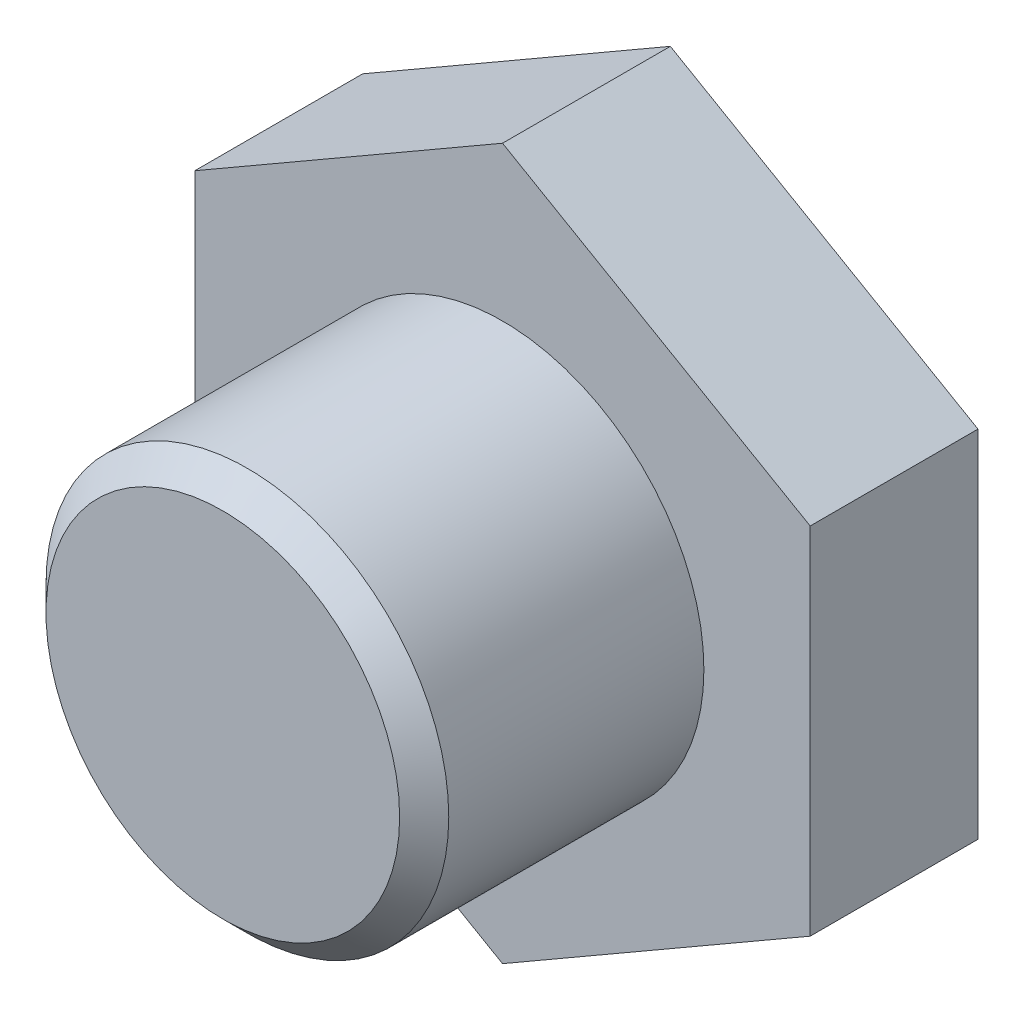
ISO-10303-21;
HEADER;
FILE_DESCRIPTION(('STEP AP214'),'2;1');
FILE_NAME('part.step','',(''),(''),'','','');
FILE_SCHEMA(('AUTOMOTIVE_DESIGN { 1 0 10303 214 1 1 1 1 }'));
ENDSEC;
DATA;
#1=APPLICATION_CONTEXT('core data for automotive mechanical design processes');
#2=APPLICATION_PROTOCOL_DEFINITION('international standard','automotive_design',2000,#1);
#3=PRODUCT_CONTEXT('',#1,'mechanical');
#4=PRODUCT('Part','Part','',(#3));
#5=PRODUCT_RELATED_PRODUCT_CATEGORY('part','',(#4));
#6=PRODUCT_DEFINITION_FORMATION('','',#4);
#7=PRODUCT_DEFINITION_CONTEXT('part definition',#1,'design');
#8=PRODUCT_DEFINITION('design','',#6,#7);
#9=PRODUCT_DEFINITION_SHAPE('','',#8);
#10=(LENGTH_UNIT() NAMED_UNIT(*) SI_UNIT(.MILLI.,.METRE.));
#11=(NAMED_UNIT(*) PLANE_ANGLE_UNIT() SI_UNIT($,.RADIAN.));
#12=(NAMED_UNIT(*) SI_UNIT($,.STERADIAN.) SOLID_ANGLE_UNIT());
#13=UNCERTAINTY_MEASURE_WITH_UNIT(LENGTH_MEASURE(1.E-05),#10,'distance_accuracy_value','');
#14=(GEOMETRIC_REPRESENTATION_CONTEXT(3) GLOBAL_UNCERTAINTY_ASSIGNED_CONTEXT((#13)) GLOBAL_UNIT_ASSIGNED_CONTEXT((#10,
#11,#12)) REPRESENTATION_CONTEXT('',''));
#15=CARTESIAN_POINT('',(0.,0.,0.));
#16=DIRECTION('',(0.,0.,1.));
#17=DIRECTION('',(1.,0.,0.));
#18=AXIS2_PLACEMENT_3D('',#15,#16,#17);
#19=CARTESIAN_POINT('',(0.,0.,15.));
#20=DIRECTION('',(0.,0.,1.));
#21=DIRECTION('',(1.,0.,0.));
#22=AXIS2_PLACEMENT_3D('',#19,#20,#21);
#23=PLANE('',#22);
#24=DIRECTION('',(-0.866025403784439,0.5,0.));
#25=VECTOR('',#24,1.);
#26=CARTESIAN_POINT('',(27.5,15.8771324027145,15.));
#27=LINE('',#26,#25);
#28=CARTESIAN_POINT('',(27.5,15.8771324027145,15.));
#29=VERTEX_POINT('',#28);
#30=CARTESIAN_POINT('',(0.,31.7542648054294,15.));
#31=VERTEX_POINT('',#30);
#32=EDGE_CURVE('E135',#29,#31,#27,.T.);
#33=ORIENTED_EDGE('',*,*,#32,.T.);
#34=DIRECTION('',(-0.866025403784439,-0.5,0.));
#35=VECTOR('',#34,1.);
#36=CARTESIAN_POINT('',(0.,31.7542648054294,15.));
#37=LINE('',#36,#35);
#38=CARTESIAN_POINT('',(-27.5,15.8771324027147,15.));
#39=VERTEX_POINT('',#38);
#40=EDGE_CURVE('E93',#31,#39,#37,.T.);
#41=ORIENTED_EDGE('',*,*,#40,.T.);
#42=DIRECTION('',(0.,-1.,0.));
#43=VECTOR('',#42,1.);
#44=CARTESIAN_POINT('',(-27.5,15.8771324027147,15.));
#45=LINE('',#44,#43);
#46=CARTESIAN_POINT('',(-27.5,-15.8771324027147,15.));
#47=VERTEX_POINT('',#46);
#48=EDGE_CURVE('E106',#39,#47,#45,.T.);
#49=ORIENTED_EDGE('',*,*,#48,.T.);
#50=DIRECTION('',(0.866025403784439,-0.5,0.));
#51=VECTOR('',#50,1.);
#52=CARTESIAN_POINT('',(-27.5,-15.8771324027147,15.));
#53=LINE('',#52,#51);
#54=CARTESIAN_POINT('',(0.,-31.7542648054294,15.));
#55=VERTEX_POINT('',#54);
#56=EDGE_CURVE('E100',#47,#55,#53,.T.);
#57=ORIENTED_EDGE('',*,*,#56,.T.);
#58=DIRECTION('',(0.866025403784439,0.5,0.));
#59=VECTOR('',#58,1.);
#60=CARTESIAN_POINT('',(0.,-31.7542648054294,15.));
#61=LINE('',#60,#59);
#62=CARTESIAN_POINT('',(27.5,-15.8771324027149,15.));
#63=VERTEX_POINT('',#62);
#64=EDGE_CURVE('E104',#55,#63,#61,.T.);
#65=ORIENTED_EDGE('',*,*,#64,.T.);
#66=DIRECTION('',(0.,1.,0.));
#67=VECTOR('',#66,1.);
#68=CARTESIAN_POINT('',(27.5,-15.8771324027149,15.));
#69=LINE('',#68,#67);
#70=EDGE_CURVE('E55',#63,#29,#69,.T.);
#71=ORIENTED_EDGE('',*,*,#70,.T.);
#72=EDGE_LOOP('',(#33,#41,#49,#57,#65,#71));
#73=FACE_BOUND('',#72,.T.);
#74=CARTESIAN_POINT('',(0.,0.,15.));
#75=DIRECTION('',(0.,0.,1.));
#76=DIRECTION('',(1.,0.,0.));
#77=AXIS2_PLACEMENT_3D('',#74,#75,#76);
#78=CIRCLE('',#77,18.);
#79=CARTESIAN_POINT('',(18.,0.,15.));
#80=VERTEX_POINT('',#79);
#81=EDGE_CURVE('E128',#80,#80,#78,.T.);
#82=ORIENTED_EDGE('',*,*,#81,.F.);
#83=EDGE_LOOP('',(#82));
#84=FACE_BOUND('',#83,.T.);
#85=ADVANCED_FACE('F38',(#73,#84),#23,.T.);
#86=CARTESIAN_POINT('',(27.5,15.8771324027145,15.));
#87=DIRECTION('',(-0.5,-0.866025403784439,0.));
#88=DIRECTION('',(0.866025403784439,-0.5,0.));
#89=AXIS2_PLACEMENT_3D('',#86,#87,#88);
#90=PLANE('',#89);
#91=DIRECTION('',(-0.866025403784439,0.5,0.));
#92=VECTOR('',#91,1.);
#93=CARTESIAN_POINT('',(27.5,15.8771324027147,0.));
#94=LINE('',#93,#92);
#95=CARTESIAN_POINT('',(27.5,15.8771324027147,0.));
#96=VERTEX_POINT('',#95);
#97=CARTESIAN_POINT('',(0.,31.7542648054294,0.));
#98=VERTEX_POINT('',#97);
#99=EDGE_CURVE('E124',#96,#98,#94,.T.);
#100=ORIENTED_EDGE('',*,*,#99,.T.);
#101=DIRECTION('',(0.,0.,-1.));
#102=VECTOR('',#101,1.);
#103=CARTESIAN_POINT('',(0.,31.7542648054294,15.));
#104=LINE('',#103,#102);
#105=EDGE_CURVE('E142',#31,#98,#104,.T.);
#106=ORIENTED_EDGE('',*,*,#105,.F.);
#107=ORIENTED_EDGE('',*,*,#32,.F.);
#108=DIRECTION('',(0.,0.,-1.));
#109=VECTOR('',#108,1.);
#110=CARTESIAN_POINT('',(27.5,15.8771324027145,15.));
#111=LINE('',#110,#109);
#112=EDGE_CURVE('E120',#29,#96,#111,.T.);
#113=ORIENTED_EDGE('',*,*,#112,.T.);
#114=EDGE_LOOP('',(#100,#106,#107,#113));
#115=FACE_BOUND('',#114,.T.);
#116=ADVANCED_FACE('F157',(#115),#90,.F.);
#117=CARTESIAN_POINT('',(0.,31.7542648054294,15.));
#118=DIRECTION('',(0.5,-0.866025403784439,0.));
#119=DIRECTION('',(0.866025403784439,0.5,0.));
#120=AXIS2_PLACEMENT_3D('',#117,#118,#119);
#121=PLANE('',#120);
#122=DIRECTION('',(-0.866025403784439,-0.5,0.));
#123=VECTOR('',#122,1.);
#124=CARTESIAN_POINT('',(0.,31.7542648054294,0.));
#125=LINE('',#124,#123);
#126=CARTESIAN_POINT('',(-27.5,15.8771324027147,0.));
#127=VERTEX_POINT('',#126);
#128=EDGE_CURVE('E127',#98,#127,#125,.T.);
#129=ORIENTED_EDGE('',*,*,#128,.T.);
#130=DIRECTION('',(0.,0.,-1.));
#131=VECTOR('',#130,1.);
#132=CARTESIAN_POINT('',(-27.5,15.8771324027147,15.));
#133=LINE('',#132,#131);
#134=EDGE_CURVE('E139',#39,#127,#133,.T.);
#135=ORIENTED_EDGE('',*,*,#134,.F.);
#136=ORIENTED_EDGE('',*,*,#40,.F.);
#137=ORIENTED_EDGE('',*,*,#105,.T.);
#138=EDGE_LOOP('',(#129,#135,#136,#137));
#139=FACE_BOUND('',#138,.T.);
#140=ADVANCED_FACE('F162',(#139),#121,.F.);
#141=CARTESIAN_POINT('',(-27.5,15.8771324027147,15.));
#142=DIRECTION('',(1.,0.,0.));
#143=DIRECTION('',(0.,0.,-1.));
#144=AXIS2_PLACEMENT_3D('',#141,#142,#143);
#145=PLANE('',#144);
#146=DIRECTION('',(0.,-1.,0.));
#147=VECTOR('',#146,1.);
#148=CARTESIAN_POINT('',(-27.5,15.8771324027147,0.));
#149=LINE('',#148,#147);
#150=CARTESIAN_POINT('',(-27.5,-15.8771324027147,0.));
#151=VERTEX_POINT('',#150);
#152=EDGE_CURVE('E130',#127,#151,#149,.T.);
#153=ORIENTED_EDGE('',*,*,#152,.T.);
#154=DIRECTION('',(0.,0.,-1.));
#155=VECTOR('',#154,1.);
#156=CARTESIAN_POINT('',(-27.5,-15.8771324027147,15.));
#157=LINE('',#156,#155);
#158=EDGE_CURVE('E115',#47,#151,#157,.T.);
#159=ORIENTED_EDGE('',*,*,#158,.F.);
#160=ORIENTED_EDGE('',*,*,#48,.F.);
#161=ORIENTED_EDGE('',*,*,#134,.T.);
#162=EDGE_LOOP('',(#153,#159,#160,#161));
#163=FACE_BOUND('',#162,.T.);
#164=ADVANCED_FACE('F177',(#163),#145,.F.);
#165=CARTESIAN_POINT('',(-27.5,-15.8771324027147,15.));
#166=DIRECTION('',(0.5,0.866025403784438,0.));
#167=DIRECTION('',(-0.866025403784439,0.5,0.));
#168=AXIS2_PLACEMENT_3D('',#165,#166,#167);
#169=PLANE('',#168);
#170=DIRECTION('',(0.866025403784439,-0.5,0.));
#171=VECTOR('',#170,1.);
#172=CARTESIAN_POINT('',(-27.5,-15.8771324027147,0.));
#173=LINE('',#172,#171);
#174=CARTESIAN_POINT('',(0.,-31.7542648054294,0.));
#175=VERTEX_POINT('',#174);
#176=EDGE_CURVE('E114',#151,#175,#173,.T.);
#177=ORIENTED_EDGE('',*,*,#176,.T.);
#178=DIRECTION('',(0.,0.,-1.));
#179=VECTOR('',#178,1.);
#180=CARTESIAN_POINT('',(0.,-31.7542648054294,15.));
#181=LINE('',#180,#179);
#182=EDGE_CURVE('E111',#55,#175,#181,.T.);
#183=ORIENTED_EDGE('',*,*,#182,.F.);
#184=ORIENTED_EDGE('',*,*,#56,.F.);
#185=ORIENTED_EDGE('',*,*,#158,.T.);
#186=EDGE_LOOP('',(#177,#183,#184,#185));
#187=FACE_BOUND('',#186,.T.);
#188=ADVANCED_FACE('F112',(#187),#169,.F.);
#189=CARTESIAN_POINT('',(0.,-31.7542648054294,15.));
#190=DIRECTION('',(-0.5,0.866025403784439,0.));
#191=DIRECTION('',(-0.866025403784439,-0.5,0.));
#192=AXIS2_PLACEMENT_3D('',#189,#190,#191);
#193=PLANE('',#192);
#194=DIRECTION('',(0.866025403784439,0.5,0.));
#195=VECTOR('',#194,1.);
#196=CARTESIAN_POINT('',(0.,-31.7542648054294,0.));
#197=LINE('',#196,#195);
#198=CARTESIAN_POINT('',(27.5,-15.8771324027147,0.));
#199=VERTEX_POINT('',#198);
#200=EDGE_CURVE('E78',#175,#199,#197,.T.);
#201=ORIENTED_EDGE('',*,*,#200,.T.);
#202=DIRECTION('',(0.,0.,-1.));
#203=VECTOR('',#202,1.);
#204=CARTESIAN_POINT('',(27.5,-15.8771324027149,15.));
#205=LINE('',#204,#203);
#206=EDGE_CURVE('E116',#63,#199,#205,.T.);
#207=ORIENTED_EDGE('',*,*,#206,.F.);
#208=ORIENTED_EDGE('',*,*,#64,.F.);
#209=ORIENTED_EDGE('',*,*,#182,.T.);
#210=EDGE_LOOP('',(#201,#207,#208,#209));
#211=FACE_BOUND('',#210,.T.);
#212=ADVANCED_FACE('F118',(#211),#193,.F.);
#213=CARTESIAN_POINT('',(27.5,-15.8771324027149,15.));
#214=DIRECTION('',(-1.,0.,0.));
#215=DIRECTION('',(0.,-1.,0.));
#216=AXIS2_PLACEMENT_3D('',#213,#214,#215);
#217=PLANE('',#216);
#218=DIRECTION('',(0.,1.,0.));
#219=VECTOR('',#218,1.);
#220=CARTESIAN_POINT('',(27.5,-15.8771324027147,0.));
#221=LINE('',#220,#219);
#222=EDGE_CURVE('E84',#199,#96,#221,.T.);
#223=ORIENTED_EDGE('',*,*,#222,.T.);
#224=ORIENTED_EDGE('',*,*,#112,.F.);
#225=ORIENTED_EDGE('',*,*,#70,.F.);
#226=ORIENTED_EDGE('',*,*,#206,.T.);
#227=EDGE_LOOP('',(#223,#224,#225,#226));
#228=FACE_BOUND('',#227,.T.);
#229=ADVANCED_FACE('F169',(#228),#217,.F.);
#230=CARTESIAN_POINT('',(0.,0.,0.));
#231=DIRECTION('',(0.,0.,1.));
#232=DIRECTION('',(1.,0.,0.));
#233=AXIS2_PLACEMENT_3D('',#230,#231,#232);
#234=PLANE('',#233);
#235=ORIENTED_EDGE('',*,*,#99,.F.);
#236=ORIENTED_EDGE('',*,*,#222,.F.);
#237=ORIENTED_EDGE('',*,*,#200,.F.);
#238=ORIENTED_EDGE('',*,*,#176,.F.);
#239=ORIENTED_EDGE('',*,*,#152,.F.);
#240=ORIENTED_EDGE('',*,*,#128,.F.);
#241=EDGE_LOOP('',(#235,#236,#237,#238,#239,#240));
#242=FACE_BOUND('',#241,.T.);
#243=ADVANCED_FACE('F166',(#242),#234,.F.);
#244=CARTESIAN_POINT('',(0.,0.,40.));
#245=DIRECTION('',(0.,0.,-1.));
#246=DIRECTION('',(-1.,0.,0.));
#247=AXIS2_PLACEMENT_3D('',#244,#245,#246);
#248=CYLINDRICAL_SURFACE('',#247,18.);
#249=CARTESIAN_POINT('',(0.,0.,37.805));
#250=DIRECTION('',(0.,0.,1.));
#251=DIRECTION('',(1.,0.,0.));
#252=AXIS2_PLACEMENT_3D('',#249,#250,#251);
#253=CIRCLE('',#252,18.);
#254=CARTESIAN_POINT('',(18.,0.,37.805));
#255=VERTEX_POINT('',#254);
#256=EDGE_CURVE('E11',#255,#255,#253,.F.);
#257=ORIENTED_EDGE('',*,*,#256,.T.);
#258=EDGE_LOOP('',(#257));
#259=FACE_BOUND('',#258,.T.);
#260=ORIENTED_EDGE('',*,*,#81,.T.);
#261=EDGE_LOOP('',(#260));
#262=FACE_BOUND('',#261,.T.);
#263=ADVANCED_FACE('F153',(#259,#262),#248,.T.);
#264=CARTESIAN_POINT('',(0.,0.,40.));
#265=DIRECTION('',(0.,0.,1.));
#266=DIRECTION('',(1.,0.,0.));
#267=AXIS2_PLACEMENT_3D('',#264,#265,#266);
#268=PLANE('',#267);
#269=CARTESIAN_POINT('',(0.,0.,40.));
#270=DIRECTION('',(0.,0.,1.));
#271=DIRECTION('',(1.,0.,0.));
#272=AXIS2_PLACEMENT_3D('',#269,#270,#271);
#273=CIRCLE('',#272,15.805);
#274=CARTESIAN_POINT('',(15.805,0.,40.));
#275=VERTEX_POINT('',#274);
#276=EDGE_CURVE('E47',#275,#275,#273,.T.);
#277=ORIENTED_EDGE('',*,*,#276,.T.);
#278=EDGE_LOOP('',(#277));
#279=FACE_BOUND('',#278,.T.);
#280=ADVANCED_FACE('F146',(#279),#268,.T.);
#281=CARTESIAN_POINT('',(0.,0.,40.));
#282=DIRECTION('',(0.,0.,-1.));
#283=DIRECTION('',(-1.,0.,0.));
#284=AXIS2_PLACEMENT_3D('',#281,#282,#283);
#285=CONICAL_SURFACE('',#284,15.805,0.785398163397446);
#286=ORIENTED_EDGE('',*,*,#256,.F.);
#287=EDGE_LOOP('',(#286));
#288=FACE_BOUND('',#287,.T.);
#289=ORIENTED_EDGE('',*,*,#276,.F.);
#290=EDGE_LOOP('',(#289));
#291=FACE_BOUND('',#290,.T.);
#292=ADVANCED_FACE('F40',(#288,#291),#285,.T.);
#293=CLOSED_SHELL('',(#85,#116,#140,#164,#188,#212,#229,#243,#263,#280,#292));
#294=MANIFOLD_SOLID_BREP('B2',#293);
#295=ADVANCED_BREP_SHAPE_REPRESENTATION('',(#18,#294),#14);
#296=SHAPE_DEFINITION_REPRESENTATION(#9,#295);
ENDSEC;
END-ISO-10303-21;
